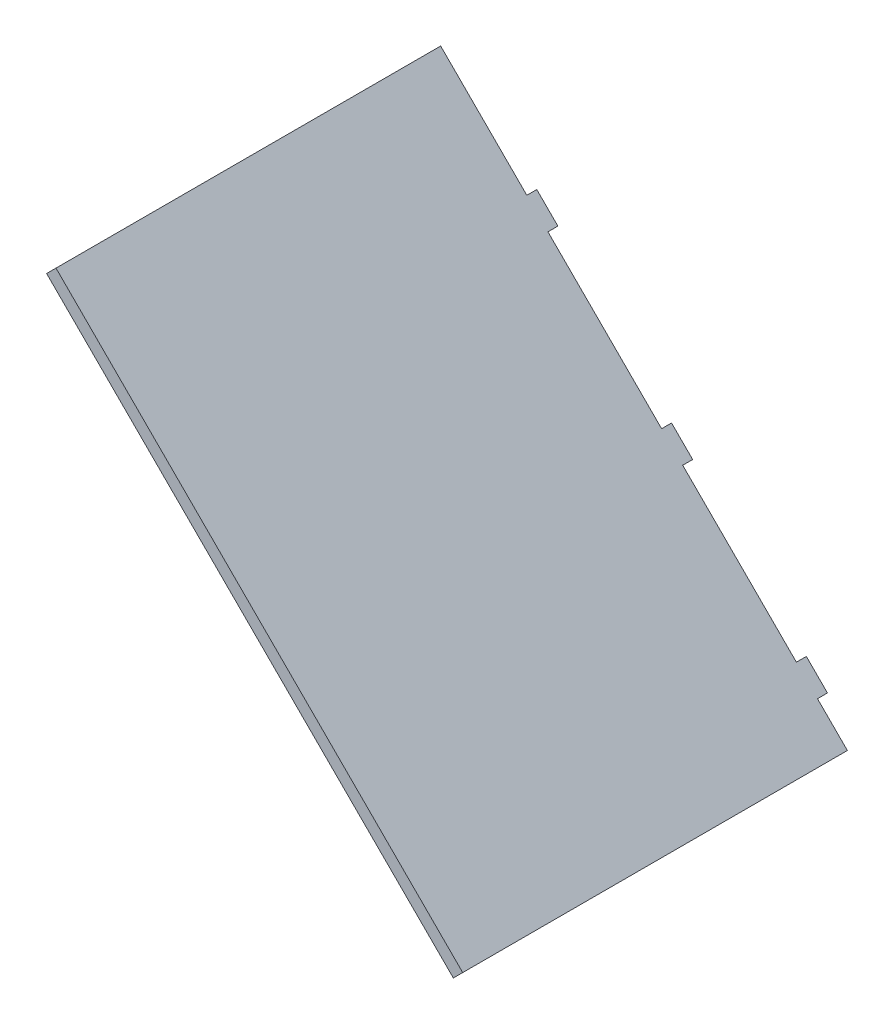
ISO-10303-21;
HEADER;
FILE_DESCRIPTION(('STEP AP214'),'2;1');
FILE_NAME('part.step','',(''),(''),'','','');
FILE_SCHEMA(('AUTOMOTIVE_DESIGN { 1 0 10303 214 1 1 1 1 }'));
ENDSEC;
DATA;
#1=APPLICATION_CONTEXT('core data for automotive mechanical design processes');
#2=APPLICATION_PROTOCOL_DEFINITION('international standard','automotive_design',2000,#1);
#3=PRODUCT_CONTEXT('',#1,'mechanical');
#4=PRODUCT('Part','Part','',(#3));
#5=PRODUCT_RELATED_PRODUCT_CATEGORY('part','',(#4));
#6=PRODUCT_DEFINITION_FORMATION('','',#4);
#7=PRODUCT_DEFINITION_CONTEXT('part definition',#1,'design');
#8=PRODUCT_DEFINITION('design','',#6,#7);
#9=PRODUCT_DEFINITION_SHAPE('','',#8);
#10=(LENGTH_UNIT() NAMED_UNIT(*) SI_UNIT(.MILLI.,.METRE.));
#11=(NAMED_UNIT(*) PLANE_ANGLE_UNIT() SI_UNIT($,.RADIAN.));
#12=(NAMED_UNIT(*) SI_UNIT($,.STERADIAN.) SOLID_ANGLE_UNIT());
#13=UNCERTAINTY_MEASURE_WITH_UNIT(LENGTH_MEASURE(1.E-05),#10,'distance_accuracy_value','');
#14=(GEOMETRIC_REPRESENTATION_CONTEXT(3) GLOBAL_UNCERTAINTY_ASSIGNED_CONTEXT((#13)) GLOBAL_UNIT_ASSIGNED_CONTEXT((#10,
#11,#12)) REPRESENTATION_CONTEXT('',''));
#15=CARTESIAN_POINT('',(0.,0.,0.));
#16=DIRECTION('',(0.,0.,1.));
#17=DIRECTION('',(1.,0.,0.));
#18=AXIS2_PLACEMENT_3D('',#15,#16,#17);
#19=CARTESIAN_POINT('',(213.828427124747,86.1715728752546,0.));
#20=DIRECTION('',(-0.707106781186547,0.707106781186548,0.));
#21=DIRECTION('',(0.,0.,-1.));
#22=AXIS2_PLACEMENT_3D('',#19,#20,#21);
#23=PLANE('',#22);
#24=DIRECTION('',(0.707106781186548,0.707106781186547,0.));
#25=VECTOR('',#24,1.);
#26=CARTESIAN_POINT('',(213.828427124747,86.1715728752546,116.));
#27=LINE('',#26,#25);
#28=CARTESIAN_POINT('',(211.000000000001,83.3431457505085,116.));
#29=VERTEX_POINT('',#28);
#30=CARTESIAN_POINT('',(213.828427124747,86.1715728752546,116.));
#31=VERTEX_POINT('',#30);
#32=EDGE_CURVE('E11',#29,#31,#27,.T.);
#33=ORIENTED_EDGE('',*,*,#32,.F.);
#34=DIRECTION('',(0.,0.,1.));
#35=VECTOR('',#34,1.);
#36=CARTESIAN_POINT('',(211.000000000001,83.3431457505085,0.));
#37=LINE('',#36,#35);
#38=CARTESIAN_POINT('',(211.000000000001,83.3431457505085,0.));
#39=VERTEX_POINT('',#38);
#40=EDGE_CURVE('E128',#29,#39,#37,.F.);
#41=ORIENTED_EDGE('',*,*,#40,.T.);
#42=DIRECTION('',(0.707106781186548,0.707106781186547,0.));
#43=VECTOR('',#42,1.);
#44=CARTESIAN_POINT('',(213.828427124747,86.1715728752546,0.));
#45=LINE('',#44,#43);
#46=CARTESIAN_POINT('',(213.828427124747,86.1715728752546,0.));
#47=VERTEX_POINT('',#46);
#48=EDGE_CURVE('E47',#39,#47,#45,.T.);
#49=ORIENTED_EDGE('',*,*,#48,.T.);
#50=DIRECTION('',(0.,0.,-1.));
#51=VECTOR('',#50,1.);
#52=CARTESIAN_POINT('',(213.828427124747,86.1715728752546,0.));
#53=LINE('',#52,#51);
#54=EDGE_CURVE('E215',#31,#47,#53,.T.);
#55=ORIENTED_EDGE('',*,*,#54,.F.);
#56=EDGE_LOOP('',(#33,#41,#49,#55));
#57=FACE_BOUND('',#56,.T.);
#58=ADVANCED_FACE('F37',(#57),#23,.F.);
#59=CARTESIAN_POINT('',(204.812619556312,95.1873804436898,0.));
#60=DIRECTION('',(0.,0.,1.));
#61=DIRECTION('',(-0.707106781186547,0.707106781186549,0.));
#62=AXIS2_PLACEMENT_3D('',#59,#60,#61);
#63=PLANE('',#62);
#64=ORIENTED_EDGE('',*,*,#48,.F.);
#65=DIRECTION('',(0.707106781186547,-0.707106781186548,0.));
#66=VECTOR('',#65,1.);
#67=CARTESIAN_POINT('',(147.171572875255,147.171572875255,0.));
#68=LINE('',#67,#66);
#69=CARTESIAN_POINT('',(201.984192431566,92.3589533189436,0.));
#70=VERTEX_POINT('',#69);
#71=EDGE_CURVE('E171',#39,#70,#68,.F.);
#72=ORIENTED_EDGE('',*,*,#71,.T.);
#73=DIRECTION('',(0.707106781186548,0.707106781186547,0.));
#74=VECTOR('',#73,1.);
#75=CARTESIAN_POINT('',(204.812619556312,95.1873804436898,0.));
#76=LINE('',#75,#74);
#77=CARTESIAN_POINT('',(204.812619556312,95.1873804436898,0.));
#78=VERTEX_POINT('',#77);
#79=EDGE_CURVE('E208',#70,#78,#76,.T.);
#80=ORIENTED_EDGE('',*,*,#79,.T.);
#81=DIRECTION('',(-0.707106781186547,0.707106781186549,0.));
#82=VECTOR('',#81,1.);
#83=CARTESIAN_POINT('',(204.812619556312,95.1873804436898,0.));
#84=LINE('',#83,#82);
#85=EDGE_CURVE('E224',#47,#78,#84,.T.);
#86=ORIENTED_EDGE('',*,*,#85,.F.);
#87=EDGE_LOOP('',(#64,#72,#80,#86));
#88=FACE_BOUND('',#87,.T.);
#89=ADVANCED_FACE('F227',(#88),#63,.F.);
#90=CARTESIAN_POINT('',(204.812619556312,95.1873804436898,-3.00000000000003));
#91=DIRECTION('',(-0.707106781186547,0.707106781186548,0.));
#92=DIRECTION('',(0.,0.,-1.));
#93=AXIS2_PLACEMENT_3D('',#90,#91,#92);
#94=PLANE('',#93);
#95=ORIENTED_EDGE('',*,*,#79,.F.);
#96=DIRECTION('',(0.,0.,1.));
#97=VECTOR('',#96,1.);
#98=CARTESIAN_POINT('',(201.984192431566,92.3589533189436,0.));
#99=LINE('',#98,#97);
#100=CARTESIAN_POINT('',(201.984192431566,92.3589533189436,-3.00000000000003));
#101=VERTEX_POINT('',#100);
#102=EDGE_CURVE('E168',#70,#101,#99,.F.);
#103=ORIENTED_EDGE('',*,*,#102,.T.);
#104=DIRECTION('',(0.707106781186548,0.707106781186547,0.));
#105=VECTOR('',#104,1.);
#106=CARTESIAN_POINT('',(204.812619556312,95.1873804436898,-3.00000000000003));
#107=LINE('',#106,#105);
#108=CARTESIAN_POINT('',(204.812619556312,95.1873804436898,-3.00000000000003));
#109=VERTEX_POINT('',#108);
#110=EDGE_CURVE('E205',#101,#109,#107,.T.);
#111=ORIENTED_EDGE('',*,*,#110,.T.);
#112=DIRECTION('',(0.,0.,-1.));
#113=VECTOR('',#112,1.);
#114=CARTESIAN_POINT('',(204.812619556312,95.1873804436898,-3.00000000000003));
#115=LINE('',#114,#113);
#116=EDGE_CURVE('E228',#78,#109,#115,.T.);
#117=ORIENTED_EDGE('',*,*,#116,.F.);
#118=EDGE_LOOP('',(#95,#103,#111,#117));
#119=FACE_BOUND('',#118,.T.);
#120=ADVANCED_FACE('F303',(#119),#94,.F.);
#121=CARTESIAN_POINT('',(198.448658525633,101.551341474369,-3.00000000000003));
#122=DIRECTION('',(0.,0.,1.));
#123=DIRECTION('',(-0.707106781186547,0.707106781186547,0.));
#124=AXIS2_PLACEMENT_3D('',#121,#122,#123);
#125=PLANE('',#124);
#126=ORIENTED_EDGE('',*,*,#110,.F.);
#127=DIRECTION('',(0.707106781186547,-0.707106781186548,0.));
#128=VECTOR('',#127,1.);
#129=CARTESIAN_POINT('',(147.171572875255,147.171572875255,-3.00000000000003));
#130=LINE('',#129,#128);
#131=CARTESIAN_POINT('',(195.620231400887,98.7229143496225,-3.00000000000003));
#132=VERTEX_POINT('',#131);
#133=EDGE_CURVE('E165',#101,#132,#130,.F.);
#134=ORIENTED_EDGE('',*,*,#133,.T.);
#135=DIRECTION('',(0.707106781186548,0.707106781186547,0.));
#136=VECTOR('',#135,1.);
#137=CARTESIAN_POINT('',(198.448658525633,101.551341474369,-3.00000000000003));
#138=LINE('',#137,#136);
#139=CARTESIAN_POINT('',(198.448658525633,101.551341474369,-3.00000000000003));
#140=VERTEX_POINT('',#139);
#141=EDGE_CURVE('E202',#132,#140,#138,.T.);
#142=ORIENTED_EDGE('',*,*,#141,.T.);
#143=DIRECTION('',(-0.707106781186547,0.707106781186547,0.));
#144=VECTOR('',#143,1.);
#145=CARTESIAN_POINT('',(198.448658525633,101.551341474369,-3.00000000000003));
#146=LINE('',#145,#144);
#147=EDGE_CURVE('E230',#109,#140,#146,.T.);
#148=ORIENTED_EDGE('',*,*,#147,.F.);
#149=EDGE_LOOP('',(#126,#134,#142,#148));
#150=FACE_BOUND('',#149,.T.);
#151=ADVANCED_FACE('F309',(#150),#125,.F.);
#152=CARTESIAN_POINT('',(198.448658525633,101.551341474369,0.));
#153=DIRECTION('',(0.707106781186547,-0.707106781186548,0.));
#154=DIRECTION('',(0.,0.,1.));
#155=AXIS2_PLACEMENT_3D('',#152,#153,#154);
#156=PLANE('',#155);
#157=ORIENTED_EDGE('',*,*,#141,.F.);
#158=DIRECTION('',(0.,0.,1.));
#159=VECTOR('',#158,1.);
#160=CARTESIAN_POINT('',(195.620231400887,98.7229143496225,0.));
#161=LINE('',#160,#159);
#162=CARTESIAN_POINT('',(195.620231400887,98.7229143496225,0.));
#163=VERTEX_POINT('',#162);
#164=EDGE_CURVE('E162',#132,#163,#161,.T.);
#165=ORIENTED_EDGE('',*,*,#164,.T.);
#166=DIRECTION('',(0.707106781186548,0.707106781186547,0.));
#167=VECTOR('',#166,1.);
#168=CARTESIAN_POINT('',(198.448658525633,101.551341474369,0.));
#169=LINE('',#168,#167);
#170=CARTESIAN_POINT('',(198.448658525633,101.551341474369,0.));
#171=VERTEX_POINT('',#170);
#172=EDGE_CURVE('E199',#163,#171,#169,.T.);
#173=ORIENTED_EDGE('',*,*,#172,.T.);
#174=DIRECTION('',(0.,0.,1.));
#175=VECTOR('',#174,1.);
#176=CARTESIAN_POINT('',(198.448658525633,101.551341474369,0.));
#177=LINE('',#176,#175);
#178=EDGE_CURVE('E236',#140,#171,#177,.T.);
#179=ORIENTED_EDGE('',*,*,#178,.F.);
#180=EDGE_LOOP('',(#157,#165,#173,#179));
#181=FACE_BOUND('',#180,.T.);
#182=ADVANCED_FACE('F312',(#181),#156,.F.);
#183=CARTESIAN_POINT('',(164.168292871246,135.831707128756,0.));
#184=DIRECTION('',(0.,0.,1.));
#185=DIRECTION('',(-0.707106781186546,0.707106781186549,0.));
#186=AXIS2_PLACEMENT_3D('',#183,#184,#185);
#187=PLANE('',#186);
#188=ORIENTED_EDGE('',*,*,#172,.F.);
#189=DIRECTION('',(0.707106781186547,-0.707106781186548,0.));
#190=VECTOR('',#189,1.);
#191=CARTESIAN_POINT('',(147.171572875255,147.171572875255,0.));
#192=LINE('',#191,#190);
#193=CARTESIAN_POINT('',(161.3398657465,133.00328000401,0.));
#194=VERTEX_POINT('',#193);
#195=EDGE_CURVE('E159',#163,#194,#192,.F.);
#196=ORIENTED_EDGE('',*,*,#195,.T.);
#197=DIRECTION('',(0.707106781186548,0.707106781186547,0.));
#198=VECTOR('',#197,1.);
#199=CARTESIAN_POINT('',(164.168292871246,135.831707128756,0.));
#200=LINE('',#199,#198);
#201=CARTESIAN_POINT('',(164.168292871246,135.831707128756,0.));
#202=VERTEX_POINT('',#201);
#203=EDGE_CURVE('E196',#194,#202,#200,.T.);
#204=ORIENTED_EDGE('',*,*,#203,.T.);
#205=DIRECTION('',(-0.707106781186546,0.707106781186549,0.));
#206=VECTOR('',#205,1.);
#207=CARTESIAN_POINT('',(164.168292871246,135.831707128756,0.));
#208=LINE('',#207,#206);
#209=EDGE_CURVE('E239',#171,#202,#208,.T.);
#210=ORIENTED_EDGE('',*,*,#209,.F.);
#211=EDGE_LOOP('',(#188,#196,#204,#210));
#212=FACE_BOUND('',#211,.T.);
#213=ADVANCED_FACE('F317',(#212),#187,.F.);
#214=CARTESIAN_POINT('',(164.168292871246,135.831707128756,-3.00000000000002));
#215=DIRECTION('',(-0.707106781186547,0.707106781186548,0.));
#216=DIRECTION('',(0.,0.,-1.));
#217=AXIS2_PLACEMENT_3D('',#214,#215,#216);
#218=PLANE('',#217);
#219=ORIENTED_EDGE('',*,*,#203,.F.);
#220=DIRECTION('',(0.,0.,1.));
#221=VECTOR('',#220,1.);
#222=CARTESIAN_POINT('',(161.3398657465,133.00328000401,0.));
#223=LINE('',#222,#221);
#224=CARTESIAN_POINT('',(161.3398657465,133.00328000401,-3.00000000000002));
#225=VERTEX_POINT('',#224);
#226=EDGE_CURVE('E156',#194,#225,#223,.F.);
#227=ORIENTED_EDGE('',*,*,#226,.T.);
#228=DIRECTION('',(0.707106781186548,0.707106781186547,0.));
#229=VECTOR('',#228,1.);
#230=CARTESIAN_POINT('',(164.168292871246,135.831707128756,-3.00000000000002));
#231=LINE('',#230,#229);
#232=CARTESIAN_POINT('',(164.168292871246,135.831707128756,-3.00000000000002));
#233=VERTEX_POINT('',#232);
#234=EDGE_CURVE('E193',#225,#233,#231,.T.);
#235=ORIENTED_EDGE('',*,*,#234,.T.);
#236=DIRECTION('',(0.,0.,-1.));
#237=VECTOR('',#236,1.);
#238=CARTESIAN_POINT('',(164.168292871246,135.831707128756,-3.00000000000002));
#239=LINE('',#238,#237);
#240=EDGE_CURVE('E242',#202,#233,#239,.T.);
#241=ORIENTED_EDGE('',*,*,#240,.F.);
#242=EDGE_LOOP('',(#219,#227,#235,#241));
#243=FACE_BOUND('',#242,.T.);
#244=ADVANCED_FACE('F322',(#243),#218,.F.);
#245=CARTESIAN_POINT('',(157.804331840567,142.195668159435,-3.00000000000002));
#246=DIRECTION('',(0.,0.,1.));
#247=DIRECTION('',(-0.707106781186547,0.707106781186547,0.));
#248=AXIS2_PLACEMENT_3D('',#245,#246,#247);
#249=PLANE('',#248);
#250=ORIENTED_EDGE('',*,*,#234,.F.);
#251=DIRECTION('',(0.707106781186547,-0.707106781186548,0.));
#252=VECTOR('',#251,1.);
#253=CARTESIAN_POINT('',(147.171572875255,147.171572875255,-3.00000000000002));
#254=LINE('',#253,#252);
#255=CARTESIAN_POINT('',(154.975904715821,139.367241034689,-3.00000000000002));
#256=VERTEX_POINT('',#255);
#257=EDGE_CURVE('E153',#225,#256,#254,.F.);
#258=ORIENTED_EDGE('',*,*,#257,.T.);
#259=DIRECTION('',(0.707106781186548,0.707106781186547,0.));
#260=VECTOR('',#259,1.);
#261=CARTESIAN_POINT('',(157.804331840567,142.195668159435,-3.00000000000002));
#262=LINE('',#261,#260);
#263=CARTESIAN_POINT('',(157.804331840567,142.195668159435,-3.00000000000002));
#264=VERTEX_POINT('',#263);
#265=EDGE_CURVE('E190',#256,#264,#262,.T.);
#266=ORIENTED_EDGE('',*,*,#265,.T.);
#267=DIRECTION('',(-0.707106781186547,0.707106781186547,0.));
#268=VECTOR('',#267,1.);
#269=CARTESIAN_POINT('',(157.804331840567,142.195668159435,-3.00000000000002));
#270=LINE('',#269,#268);
#271=EDGE_CURVE('E245',#233,#264,#270,.T.);
#272=ORIENTED_EDGE('',*,*,#271,.F.);
#273=EDGE_LOOP('',(#250,#258,#266,#272));
#274=FACE_BOUND('',#273,.T.);
#275=ADVANCED_FACE('F324',(#274),#249,.F.);
#276=CARTESIAN_POINT('',(157.804331840567,142.195668159435,0.));
#277=DIRECTION('',(0.707106781186547,-0.707106781186548,0.));
#278=DIRECTION('',(0.,0.,1.));
#279=AXIS2_PLACEMENT_3D('',#276,#277,#278);
#280=PLANE('',#279);
#281=ORIENTED_EDGE('',*,*,#265,.F.);
#282=DIRECTION('',(0.,0.,1.));
#283=VECTOR('',#282,1.);
#284=CARTESIAN_POINT('',(154.975904715821,139.367241034689,0.));
#285=LINE('',#284,#283);
#286=CARTESIAN_POINT('',(154.975904715821,139.367241034689,0.));
#287=VERTEX_POINT('',#286);
#288=EDGE_CURVE('E150',#256,#287,#285,.T.);
#289=ORIENTED_EDGE('',*,*,#288,.T.);
#290=DIRECTION('',(0.707106781186548,0.707106781186547,0.));
#291=VECTOR('',#290,1.);
#292=CARTESIAN_POINT('',(157.804331840567,142.195668159435,0.));
#293=LINE('',#292,#291);
#294=CARTESIAN_POINT('',(157.804331840567,142.195668159435,0.));
#295=VERTEX_POINT('',#294);
#296=EDGE_CURVE('E187',#287,#295,#293,.T.);
#297=ORIENTED_EDGE('',*,*,#296,.T.);
#298=DIRECTION('',(0.,0.,1.));
#299=VECTOR('',#298,1.);
#300=CARTESIAN_POINT('',(157.804331840567,142.195668159435,0.));
#301=LINE('',#300,#299);
#302=EDGE_CURVE('E248',#264,#295,#301,.T.);
#303=ORIENTED_EDGE('',*,*,#302,.F.);
#304=EDGE_LOOP('',(#281,#289,#297,#303));
#305=FACE_BOUND('',#304,.T.);
#306=ADVANCED_FACE('F326',(#305),#280,.F.);
#307=CARTESIAN_POINT('',(123.52396618618,176.476033813823,0.));
#308=DIRECTION('',(0.,0.,1.));
#309=DIRECTION('',(-0.707106781186546,0.707106781186549,0.));
#310=AXIS2_PLACEMENT_3D('',#307,#308,#309);
#311=PLANE('',#310);
#312=ORIENTED_EDGE('',*,*,#296,.F.);
#313=DIRECTION('',(0.707106781186547,-0.707106781186548,0.));
#314=VECTOR('',#313,1.);
#315=CARTESIAN_POINT('',(147.171572875255,147.171572875255,0.));
#316=LINE('',#315,#314);
#317=CARTESIAN_POINT('',(120.695539061433,173.647606689076,0.));
#318=VERTEX_POINT('',#317);
#319=EDGE_CURVE('E147',#287,#318,#316,.F.);
#320=ORIENTED_EDGE('',*,*,#319,.T.);
#321=DIRECTION('',(0.707106781186548,0.707106781186547,0.));
#322=VECTOR('',#321,1.);
#323=CARTESIAN_POINT('',(123.52396618618,176.476033813823,0.));
#324=LINE('',#323,#322);
#325=CARTESIAN_POINT('',(123.52396618618,176.476033813823,0.));
#326=VERTEX_POINT('',#325);
#327=EDGE_CURVE('E184',#318,#326,#324,.T.);
#328=ORIENTED_EDGE('',*,*,#327,.T.);
#329=DIRECTION('',(-0.707106781186546,0.707106781186549,0.));
#330=VECTOR('',#329,1.);
#331=CARTESIAN_POINT('',(123.52396618618,176.476033813823,0.));
#332=LINE('',#331,#330);
#333=EDGE_CURVE('E251',#295,#326,#332,.T.);
#334=ORIENTED_EDGE('',*,*,#333,.F.);
#335=EDGE_LOOP('',(#312,#320,#328,#334));
#336=FACE_BOUND('',#335,.T.);
#337=ADVANCED_FACE('F283',(#336),#311,.F.);
#338=CARTESIAN_POINT('',(123.52396618618,176.476033813823,-3.00000000000002));
#339=DIRECTION('',(-0.707106781186547,0.707106781186548,0.));
#340=DIRECTION('',(0.,0.,-1.));
#341=AXIS2_PLACEMENT_3D('',#338,#339,#340);
#342=PLANE('',#341);
#343=ORIENTED_EDGE('',*,*,#327,.F.);
#344=DIRECTION('',(0.,0.,1.));
#345=VECTOR('',#344,1.);
#346=CARTESIAN_POINT('',(120.695539061433,173.647606689076,0.));
#347=LINE('',#346,#345);
#348=CARTESIAN_POINT('',(120.695539061433,173.647606689076,-3.00000000000002));
#349=VERTEX_POINT('',#348);
#350=EDGE_CURVE('E144',#318,#349,#347,.F.);
#351=ORIENTED_EDGE('',*,*,#350,.T.);
#352=DIRECTION('',(0.707106781186548,0.707106781186547,0.));
#353=VECTOR('',#352,1.);
#354=CARTESIAN_POINT('',(123.52396618618,176.476033813823,-3.00000000000002));
#355=LINE('',#354,#353);
#356=CARTESIAN_POINT('',(123.52396618618,176.476033813823,-3.00000000000002));
#357=VERTEX_POINT('',#356);
#358=EDGE_CURVE('E181',#349,#357,#355,.T.);
#359=ORIENTED_EDGE('',*,*,#358,.T.);
#360=DIRECTION('',(0.,0.,-1.));
#361=VECTOR('',#360,1.);
#362=CARTESIAN_POINT('',(123.52396618618,176.476033813823,-3.00000000000002));
#363=LINE('',#362,#361);
#364=EDGE_CURVE('E254',#326,#357,#363,.T.);
#365=ORIENTED_EDGE('',*,*,#364,.F.);
#366=EDGE_LOOP('',(#343,#351,#359,#365));
#367=FACE_BOUND('',#366,.T.);
#368=ADVANCED_FACE('F275',(#367),#342,.F.);
#369=CARTESIAN_POINT('',(117.160005155501,182.839994844501,-3.));
#370=DIRECTION('',(0.,0.,1.));
#371=DIRECTION('',(-0.707106781186547,0.707106781186547,0.));
#372=AXIS2_PLACEMENT_3D('',#369,#370,#371);
#373=PLANE('',#372);
#374=ORIENTED_EDGE('',*,*,#358,.F.);
#375=DIRECTION('',(0.707106781186547,-0.707106781186548,0.));
#376=VECTOR('',#375,1.);
#377=CARTESIAN_POINT('',(147.171572875255,147.171572875255,-3.00000000000002));
#378=LINE('',#377,#376);
#379=CARTESIAN_POINT('',(114.331578030755,180.011567719755,-3.));
#380=VERTEX_POINT('',#379);
#381=EDGE_CURVE('E141',#349,#380,#378,.F.);
#382=ORIENTED_EDGE('',*,*,#381,.T.);
#383=DIRECTION('',(0.707106781186548,0.707106781186547,0.));
#384=VECTOR('',#383,1.);
#385=CARTESIAN_POINT('',(117.160005155501,182.839994844501,-3.));
#386=LINE('',#385,#384);
#387=CARTESIAN_POINT('',(117.160005155501,182.839994844501,-3.));
#388=VERTEX_POINT('',#387);
#389=EDGE_CURVE('E178',#380,#388,#386,.T.);
#390=ORIENTED_EDGE('',*,*,#389,.T.);
#391=DIRECTION('',(-0.707106781186547,0.707106781186547,0.));
#392=VECTOR('',#391,1.);
#393=CARTESIAN_POINT('',(117.160005155501,182.839994844501,-3.));
#394=LINE('',#393,#392);
#395=EDGE_CURVE('E257',#357,#388,#394,.T.);
#396=ORIENTED_EDGE('',*,*,#395,.F.);
#397=EDGE_LOOP('',(#374,#382,#390,#396));
#398=FACE_BOUND('',#397,.T.);
#399=ADVANCED_FACE('F270',(#398),#373,.F.);
#400=CARTESIAN_POINT('',(117.160005155501,182.839994844501,0.));
#401=DIRECTION('',(0.707106781186547,-0.707106781186548,0.));
#402=DIRECTION('',(0.,0.,1.));
#403=AXIS2_PLACEMENT_3D('',#400,#401,#402);
#404=PLANE('',#403);
#405=ORIENTED_EDGE('',*,*,#389,.F.);
#406=DIRECTION('',(0.,0.,1.));
#407=VECTOR('',#406,1.);
#408=CARTESIAN_POINT('',(114.331578030755,180.011567719755,0.));
#409=LINE('',#408,#407);
#410=CARTESIAN_POINT('',(114.331578030755,180.011567719755,0.));
#411=VERTEX_POINT('',#410);
#412=EDGE_CURVE('E138',#380,#411,#409,.T.);
#413=ORIENTED_EDGE('',*,*,#412,.T.);
#414=DIRECTION('',(0.707106781186548,0.707106781186547,0.));
#415=VECTOR('',#414,1.);
#416=CARTESIAN_POINT('',(117.160005155501,182.839994844501,0.));
#417=LINE('',#416,#415);
#418=CARTESIAN_POINT('',(117.160005155501,182.839994844501,0.));
#419=VERTEX_POINT('',#418);
#420=EDGE_CURVE('E176',#411,#419,#417,.T.);
#421=ORIENTED_EDGE('',*,*,#420,.T.);
#422=DIRECTION('',(0.,0.,1.));
#423=VECTOR('',#422,1.);
#424=CARTESIAN_POINT('',(117.160005155501,182.839994844501,0.));
#425=LINE('',#424,#423);
#426=EDGE_CURVE('E259',#388,#419,#425,.T.);
#427=ORIENTED_EDGE('',*,*,#426,.F.);
#428=EDGE_LOOP('',(#405,#413,#421,#427));
#429=FACE_BOUND('',#428,.T.);
#430=ADVANCED_FACE('F266',(#429),#404,.F.);
#431=CARTESIAN_POINT('',(91.1715728752548,208.828427124747,0.));
#432=DIRECTION('',(0.,0.,1.));
#433=DIRECTION('',(-0.707106781186547,0.707106781186548,0.));
#434=AXIS2_PLACEMENT_3D('',#431,#432,#433);
#435=PLANE('',#434);
#436=ORIENTED_EDGE('',*,*,#420,.F.);
#437=DIRECTION('',(0.707106781186547,-0.707106781186548,0.));
#438=VECTOR('',#437,1.);
#439=CARTESIAN_POINT('',(147.171572875255,147.171572875255,0.));
#440=LINE('',#439,#438);
#441=CARTESIAN_POINT('',(88.3431457505086,206.000000000001,0.));
#442=VERTEX_POINT('',#441);
#443=EDGE_CURVE('E135',#411,#442,#440,.F.);
#444=ORIENTED_EDGE('',*,*,#443,.T.);
#445=DIRECTION('',(0.707106781186548,0.707106781186547,0.));
#446=VECTOR('',#445,1.);
#447=CARTESIAN_POINT('',(91.1715728752548,208.828427124747,0.));
#448=LINE('',#447,#446);
#449=CARTESIAN_POINT('',(91.1715728752548,208.828427124747,0.));
#450=VERTEX_POINT('',#449);
#451=EDGE_CURVE('E55',#442,#450,#448,.T.);
#452=ORIENTED_EDGE('',*,*,#451,.T.);
#453=DIRECTION('',(-0.707106781186547,0.707106781186548,0.));
#454=VECTOR('',#453,1.);
#455=CARTESIAN_POINT('',(91.1715728752548,208.828427124747,0.));
#456=LINE('',#455,#454);
#457=EDGE_CURVE('E121',#419,#450,#456,.T.);
#458=ORIENTED_EDGE('',*,*,#457,.F.);
#459=EDGE_LOOP('',(#436,#444,#452,#458));
#460=FACE_BOUND('',#459,.T.);
#461=ADVANCED_FACE('F263',(#460),#435,.F.);
#462=CARTESIAN_POINT('',(91.1715728752548,208.828427124747,116.));
#463=DIRECTION('',(0.707106781186547,-0.707106781186548,0.));
#464=DIRECTION('',(0.,0.,1.));
#465=AXIS2_PLACEMENT_3D('',#462,#463,#464);
#466=PLANE('',#465);
#467=ORIENTED_EDGE('',*,*,#451,.F.);
#468=DIRECTION('',(0.,0.,1.));
#469=VECTOR('',#468,1.);
#470=CARTESIAN_POINT('',(88.3431457505086,206.000000000001,0.));
#471=LINE('',#470,#469);
#472=CARTESIAN_POINT('',(88.3431457505086,206.000000000001,116.));
#473=VERTEX_POINT('',#472);
#474=EDGE_CURVE('E126',#442,#473,#471,.T.);
#475=ORIENTED_EDGE('',*,*,#474,.T.);
#476=DIRECTION('',(0.707106781186548,0.707106781186547,0.));
#477=VECTOR('',#476,1.);
#478=CARTESIAN_POINT('',(91.1715728752548,208.828427124747,116.));
#479=LINE('',#478,#477);
#480=CARTESIAN_POINT('',(91.1715728752548,208.828427124747,116.));
#481=VERTEX_POINT('',#480);
#482=EDGE_CURVE('E41',#473,#481,#479,.T.);
#483=ORIENTED_EDGE('',*,*,#482,.T.);
#484=DIRECTION('',(0.,0.,1.));
#485=VECTOR('',#484,1.);
#486=CARTESIAN_POINT('',(91.1715728752548,208.828427124747,116.));
#487=LINE('',#486,#485);
#488=EDGE_CURVE('E137',#450,#481,#487,.T.);
#489=ORIENTED_EDGE('',*,*,#488,.F.);
#490=EDGE_LOOP('',(#467,#475,#483,#489));
#491=FACE_BOUND('',#490,.T.);
#492=ADVANCED_FACE('F130',(#491),#466,.F.);
#493=CARTESIAN_POINT('',(213.828427124747,86.1715728752546,116.));
#494=DIRECTION('',(0.,0.,-1.));
#495=DIRECTION('',(0.707106781186547,-0.707106781186548,0.));
#496=AXIS2_PLACEMENT_3D('',#493,#494,#495);
#497=PLANE('',#496);
#498=DIRECTION('',(0.707106781186547,-0.707106781186548,0.));
#499=VECTOR('',#498,1.);
#500=CARTESIAN_POINT('',(147.171572875255,147.171572875255,116.));
#501=LINE('',#500,#499);
#502=EDGE_CURVE('E115',#473,#29,#501,.T.);
#503=ORIENTED_EDGE('',*,*,#502,.T.);
#504=ORIENTED_EDGE('',*,*,#32,.T.);
#505=DIRECTION('',(0.707106781186547,-0.707106781186548,0.));
#506=VECTOR('',#505,1.);
#507=CARTESIAN_POINT('',(213.828427124747,86.1715728752546,116.));
#508=LINE('',#507,#506);
#509=EDGE_CURVE('E117',#481,#31,#508,.T.);
#510=ORIENTED_EDGE('',*,*,#509,.F.);
#511=ORIENTED_EDGE('',*,*,#482,.F.);
#512=EDGE_LOOP('',(#503,#504,#510,#511));
#513=FACE_BOUND('',#512,.T.);
#514=ADVANCED_FACE('F39',(#513),#497,.F.);
#515=CARTESIAN_POINT('',(150.000000000001,150.000000000001,0.));
#516=DIRECTION('',(-0.707106781186548,-0.707106781186547,0.));
#517=DIRECTION('',(0.707106781186547,-0.707106781186548,0.));
#518=AXIS2_PLACEMENT_3D('',#515,#516,#517);
#519=PLANE('',#518);
#520=ORIENTED_EDGE('',*,*,#488,.T.);
#521=ORIENTED_EDGE('',*,*,#509,.T.);
#522=ORIENTED_EDGE('',*,*,#54,.T.);
#523=ORIENTED_EDGE('',*,*,#85,.T.);
#524=ORIENTED_EDGE('',*,*,#116,.T.);
#525=ORIENTED_EDGE('',*,*,#147,.T.);
#526=ORIENTED_EDGE('',*,*,#178,.T.);
#527=ORIENTED_EDGE('',*,*,#209,.T.);
#528=ORIENTED_EDGE('',*,*,#240,.T.);
#529=ORIENTED_EDGE('',*,*,#271,.T.);
#530=ORIENTED_EDGE('',*,*,#302,.T.);
#531=ORIENTED_EDGE('',*,*,#333,.T.);
#532=ORIENTED_EDGE('',*,*,#364,.T.);
#533=ORIENTED_EDGE('',*,*,#395,.T.);
#534=ORIENTED_EDGE('',*,*,#426,.T.);
#535=ORIENTED_EDGE('',*,*,#457,.T.);
#536=EDGE_LOOP('',(#520,#521,#522,#523,#524,#525,#526,#527,#528,#529,#530,#531,#532,#533,#534,#535));
#537=FACE_BOUND('',#536,.T.);
#538=ADVANCED_FACE('F222',(#537),#519,.F.);
#539=CARTESIAN_POINT('',(147.171572875255,147.171572875255,0.));
#540=DIRECTION('',(-0.707106781186548,-0.707106781186547,0.));
#541=DIRECTION('',(0.707106781186547,-0.707106781186548,0.));
#542=AXIS2_PLACEMENT_3D('',#539,#540,#541);
#543=PLANE('',#542);
#544=ORIENTED_EDGE('',*,*,#474,.F.);
#545=ORIENTED_EDGE('',*,*,#443,.F.);
#546=ORIENTED_EDGE('',*,*,#412,.F.);
#547=ORIENTED_EDGE('',*,*,#381,.F.);
#548=ORIENTED_EDGE('',*,*,#350,.F.);
#549=ORIENTED_EDGE('',*,*,#319,.F.);
#550=ORIENTED_EDGE('',*,*,#288,.F.);
#551=ORIENTED_EDGE('',*,*,#257,.F.);
#552=ORIENTED_EDGE('',*,*,#226,.F.);
#553=ORIENTED_EDGE('',*,*,#195,.F.);
#554=ORIENTED_EDGE('',*,*,#164,.F.);
#555=ORIENTED_EDGE('',*,*,#133,.F.);
#556=ORIENTED_EDGE('',*,*,#102,.F.);
#557=ORIENTED_EDGE('',*,*,#71,.F.);
#558=ORIENTED_EDGE('',*,*,#40,.F.);
#559=ORIENTED_EDGE('',*,*,#502,.F.);
#560=EDGE_LOOP('',(#544,#545,#546,#547,#548,#549,#550,#551,#552,#553,#554,#555,#556,#557,#558,#559));
#561=FACE_BOUND('',#560,.T.);
#562=ADVANCED_FACE('F124',(#561),#543,.T.);
#563=CLOSED_SHELL('',(#58,#89,#120,#151,#182,#213,#244,#275,#306,#337,#368,#399,#430,#461,#492,
#514,#538,#562));
#564=MANIFOLD_SOLID_BREP('B2',#563);
#565=ADVANCED_BREP_SHAPE_REPRESENTATION('',(#18,#564),#14);
#566=SHAPE_DEFINITION_REPRESENTATION(#9,#565);
ENDSEC;
END-ISO-10303-21;
